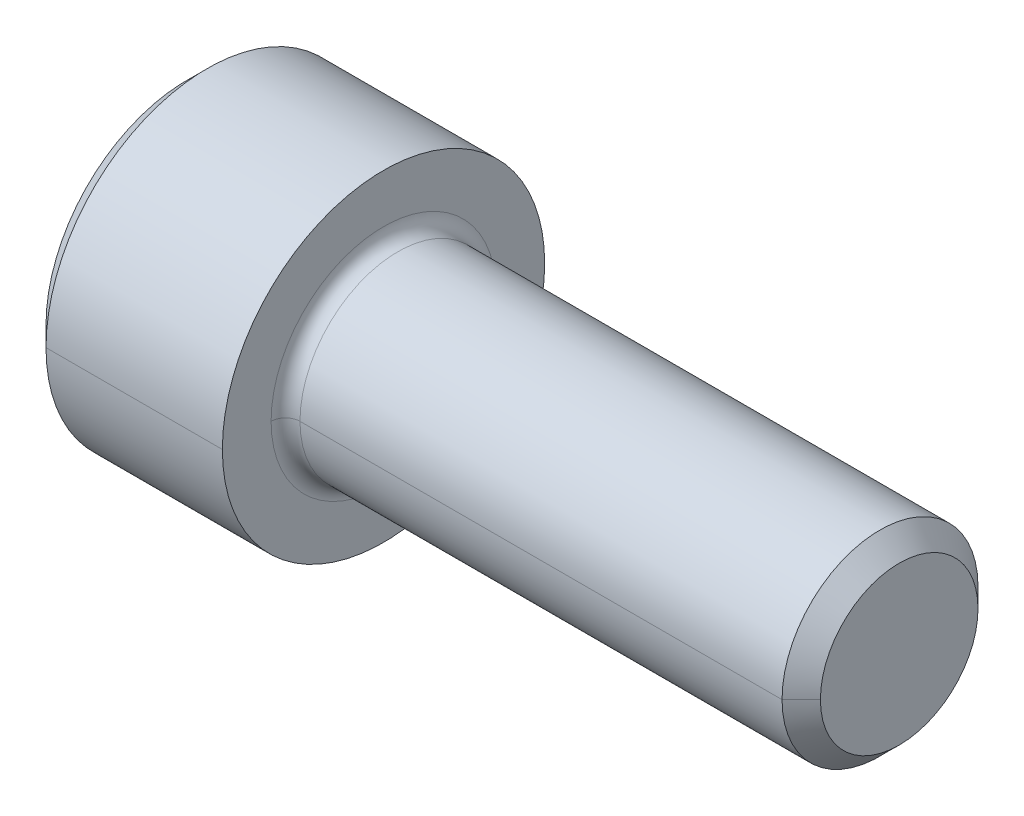
ISO-10303-21;
HEADER;
FILE_DESCRIPTION(('STEP AP214'),'2;1');
FILE_NAME('part.step','',(''),(''),'','','');
FILE_SCHEMA(('AUTOMOTIVE_DESIGN { 1 0 10303 214 1 1 1 1 }'));
ENDSEC;
DATA;
#1=APPLICATION_CONTEXT('core data for automotive mechanical design processes');
#2=APPLICATION_PROTOCOL_DEFINITION('international standard','automotive_design',2000,#1);
#3=PRODUCT_CONTEXT('',#1,'mechanical');
#4=PRODUCT('Part','Part','',(#3));
#5=PRODUCT_RELATED_PRODUCT_CATEGORY('part','',(#4));
#6=PRODUCT_DEFINITION_FORMATION('','',#4);
#7=PRODUCT_DEFINITION_CONTEXT('part definition',#1,'design');
#8=PRODUCT_DEFINITION('design','',#6,#7);
#9=PRODUCT_DEFINITION_SHAPE('','',#8);
#10=(LENGTH_UNIT() NAMED_UNIT(*) SI_UNIT(.MILLI.,.METRE.));
#11=(NAMED_UNIT(*) PLANE_ANGLE_UNIT() SI_UNIT($,.RADIAN.));
#12=(NAMED_UNIT(*) SI_UNIT($,.STERADIAN.) SOLID_ANGLE_UNIT());
#13=UNCERTAINTY_MEASURE_WITH_UNIT(LENGTH_MEASURE(1.E-05),#10,'distance_accuracy_value','');
#14=(GEOMETRIC_REPRESENTATION_CONTEXT(3) GLOBAL_UNCERTAINTY_ASSIGNED_CONTEXT((#13)) GLOBAL_UNIT_ASSIGNED_CONTEXT((#10,
#11,#12)) REPRESENTATION_CONTEXT('',''));
#15=CARTESIAN_POINT('',(0.,0.,0.));
#16=DIRECTION('',(0.,0.,1.));
#17=DIRECTION('',(1.,0.,0.));
#18=AXIS2_PLACEMENT_3D('',#15,#16,#17);
#19=CARTESIAN_POINT('',(2.286,0.,0.));
#20=DIRECTION('',(-1.,0.,0.));
#21=DIRECTION('',(0.,0.,1.));
#22=AXIS2_PLACEMENT_3D('',#19,#20,#21);
#23=CONICAL_SURFACE('',#22,1.98501,1.0471975511966);
#24=DIRECTION('',(-0.5,0.,-0.866025403784437));
#25=VECTOR('',#24,1.);
#26=CARTESIAN_POINT('',(2.286,0.,-1.98501));
#27=LINE('',#26,#25);
#28=CARTESIAN_POINT('',(3.43204605784411,0.,0.));
#29=VERTEX_POINT('',#28);
#30=CARTESIAN_POINT('',(2.286,0.,-1.98501));
#31=VERTEX_POINT('',#30);
#32=EDGE_CURVE('E367',#29,#31,#27,.T.);
#33=ORIENTED_EDGE('',*,*,#32,.F.);
#34=DIRECTION('',(-0.5,0.,0.866025403784437));
#35=VECTOR('',#34,1.);
#36=CARTESIAN_POINT('',(2.286,0.,1.98501));
#37=LINE('',#36,#35);
#38=CARTESIAN_POINT('',(2.286,0.,1.98501));
#39=VERTEX_POINT('',#38);
#40=EDGE_CURVE('E410',#29,#39,#37,.T.);
#41=ORIENTED_EDGE('',*,*,#40,.T.);
#42=CARTESIAN_POINT('',(2.286,0.,0.));
#43=DIRECTION('',(-1.,0.,0.));
#44=DIRECTION('',(0.,0.,1.));
#45=AXIS2_PLACEMENT_3D('',#42,#43,#44);
#46=CIRCLE('',#45,1.98501);
#47=CARTESIAN_POINT('',(2.286,1.71906908676615,0.992505));
#48=VERTEX_POINT('',#47);
#49=EDGE_CURVE('E11',#39,#48,#46,.T.);
#50=ORIENTED_EDGE('',*,*,#49,.T.);
#51=CARTESIAN_POINT('',(2.286,0.,0.));
#52=DIRECTION('',(-1.,0.,0.));
#53=DIRECTION('',(0.,0.,1.));
#54=AXIS2_PLACEMENT_3D('',#51,#52,#53);
#55=CIRCLE('',#54,1.98501);
#56=CARTESIAN_POINT('',(2.286,1.71906908676615,-0.992505));
#57=VERTEX_POINT('',#56);
#58=EDGE_CURVE('E26',#48,#57,#55,.T.);
#59=ORIENTED_EDGE('',*,*,#58,.T.);
#60=CARTESIAN_POINT('',(2.286,0.,0.));
#61=DIRECTION('',(-1.,0.,0.));
#62=DIRECTION('',(0.,0.,1.));
#63=AXIS2_PLACEMENT_3D('',#60,#61,#62);
#64=CIRCLE('',#63,1.98501);
#65=EDGE_CURVE('E204',#57,#31,#64,.T.);
#66=ORIENTED_EDGE('',*,*,#65,.T.);
#67=EDGE_LOOP('',(#33,#41,#50,#59,#66));
#68=FACE_BOUND('',#67,.T.);
#69=ADVANCED_FACE('F17',(#68),#23,.F.);
#70=CARTESIAN_POINT('',(2.286,1.14604605784411,1.98501));
#71=DIRECTION('',(-1.,0.,0.));
#72=DIRECTION('',(0.,0.,1.));
#73=AXIS2_PLACEMENT_3D('',#70,#71,#72);
#74=PLANE('',#73);
#75=ORIENTED_EDGE('',*,*,#49,.F.);
#76=DIRECTION('',(0.,1.,0.));
#77=VECTOR('',#76,1.);
#78=CARTESIAN_POINT('',(2.286,-1.14604605784409,1.98501));
#79=LINE('',#78,#77);
#80=CARTESIAN_POINT('',(2.286,1.14604605784411,1.98501));
#81=VERTEX_POINT('',#80);
#82=EDGE_CURVE('E263',#39,#81,#79,.T.);
#83=ORIENTED_EDGE('',*,*,#82,.T.);
#84=DIRECTION('',(0.,-0.5,0.86602540378444));
#85=VECTOR('',#84,1.);
#86=CARTESIAN_POINT('',(2.286,2.29209211568821,0.));
#87=LINE('',#86,#85);
#88=EDGE_CURVE('E310',#48,#81,#87,.T.);
#89=ORIENTED_EDGE('',*,*,#88,.F.);
#90=EDGE_LOOP('',(#75,#83,#89));
#91=FACE_BOUND('',#90,.T.);
#92=ADVANCED_FACE('F807',(#91),#74,.T.);
#93=CARTESIAN_POINT('',(2.286,1.14604605784411,1.98501));
#94=DIRECTION('',(-1.,0.,0.));
#95=DIRECTION('',(0.,0.,1.));
#96=AXIS2_PLACEMENT_3D('',#93,#94,#95);
#97=PLANE('',#96);
#98=ORIENTED_EDGE('',*,*,#58,.F.);
#99=DIRECTION('',(0.,-0.5,0.86602540378444));
#100=VECTOR('',#99,1.);
#101=CARTESIAN_POINT('',(2.286,2.29209211568821,0.));
#102=LINE('',#101,#100);
#103=CARTESIAN_POINT('',(2.286,2.29209211568821,0.));
#104=VERTEX_POINT('',#103);
#105=EDGE_CURVE('E306',#104,#48,#102,.T.);
#106=ORIENTED_EDGE('',*,*,#105,.F.);
#107=DIRECTION('',(0.,-0.5,-0.866025403784438));
#108=VECTOR('',#107,1.);
#109=CARTESIAN_POINT('',(2.286,2.29209211568821,0.));
#110=LINE('',#109,#108);
#111=EDGE_CURVE('E200',#104,#57,#110,.T.);
#112=ORIENTED_EDGE('',*,*,#111,.T.);
#113=EDGE_LOOP('',(#98,#106,#112));
#114=FACE_BOUND('',#113,.T.);
#115=ADVANCED_FACE('F617',(#114),#97,.T.);
#116=CARTESIAN_POINT('',(2.286,1.14604605784411,1.98501));
#117=DIRECTION('',(-1.,0.,0.));
#118=DIRECTION('',(0.,0.,1.));
#119=AXIS2_PLACEMENT_3D('',#116,#117,#118);
#120=PLANE('',#119);
#121=ORIENTED_EDGE('',*,*,#65,.F.);
#122=DIRECTION('',(0.,-0.5,-0.866025403784438));
#123=VECTOR('',#122,1.);
#124=CARTESIAN_POINT('',(2.286,2.29209211568821,0.));
#125=LINE('',#124,#123);
#126=CARTESIAN_POINT('',(2.286,1.1460460578441,-1.98501));
#127=VERTEX_POINT('',#126);
#128=EDGE_CURVE('E199',#57,#127,#125,.T.);
#129=ORIENTED_EDGE('',*,*,#128,.T.);
#130=DIRECTION('',(0.,-1.,0.));
#131=VECTOR('',#130,1.);
#132=CARTESIAN_POINT('',(2.286,1.1460460578441,-1.98501));
#133=LINE('',#132,#131);
#134=EDGE_CURVE('E170',#127,#31,#133,.T.);
#135=ORIENTED_EDGE('',*,*,#134,.T.);
#136=EDGE_LOOP('',(#121,#129,#135));
#137=FACE_BOUND('',#136,.T.);
#138=ADVANCED_FACE('F613',(#137),#120,.T.);
#139=CARTESIAN_POINT('',(2.286,1.14604605784411,1.98501));
#140=DIRECTION('',(-1.,0.,0.));
#141=DIRECTION('',(0.,0.,1.));
#142=AXIS2_PLACEMENT_3D('',#139,#140,#141);
#143=PLANE('',#142);
#144=CARTESIAN_POINT('',(2.286,0.,0.));
#145=DIRECTION('',(-1.,0.,0.));
#146=DIRECTION('',(0.,0.,1.));
#147=AXIS2_PLACEMENT_3D('',#144,#145,#146);
#148=CIRCLE('',#147,1.98501);
#149=CARTESIAN_POINT('',(2.286,-1.71906908676615,-0.992505));
#150=VERTEX_POINT('',#149);
#151=EDGE_CURVE('E165',#31,#150,#148,.T.);
#152=ORIENTED_EDGE('',*,*,#151,.F.);
#153=DIRECTION('',(0.,-1.,0.));
#154=VECTOR('',#153,1.);
#155=CARTESIAN_POINT('',(2.286,1.1460460578441,-1.98501));
#156=LINE('',#155,#154);
#157=CARTESIAN_POINT('',(2.286,-1.1460460578441,-1.98501));
#158=VERTEX_POINT('',#157);
#159=EDGE_CURVE('E158',#31,#158,#156,.T.);
#160=ORIENTED_EDGE('',*,*,#159,.T.);
#161=DIRECTION('',(0.,0.5,-0.86602540378444));
#162=VECTOR('',#161,1.);
#163=CARTESIAN_POINT('',(2.286,-2.2920921156882,0.));
#164=LINE('',#163,#162);
#165=EDGE_CURVE('E162',#150,#158,#164,.T.);
#166=ORIENTED_EDGE('',*,*,#165,.F.);
#167=EDGE_LOOP('',(#152,#160,#166));
#168=FACE_BOUND('',#167,.T.);
#169=ADVANCED_FACE('F160',(#168),#143,.T.);
#170=CARTESIAN_POINT('',(2.286,1.14604605784411,1.98501));
#171=DIRECTION('',(-1.,0.,0.));
#172=DIRECTION('',(0.,0.,1.));
#173=AXIS2_PLACEMENT_3D('',#170,#171,#172);
#174=PLANE('',#173);
#175=CARTESIAN_POINT('',(2.286,0.,0.));
#176=DIRECTION('',(-1.,0.,0.));
#177=DIRECTION('',(0.,0.,1.));
#178=AXIS2_PLACEMENT_3D('',#175,#176,#177);
#179=CIRCLE('',#178,1.98501);
#180=CARTESIAN_POINT('',(2.286,-1.71906908676614,0.992505));
#181=VERTEX_POINT('',#180);
#182=EDGE_CURVE('E358',#150,#181,#179,.T.);
#183=ORIENTED_EDGE('',*,*,#182,.F.);
#184=DIRECTION('',(0.,0.5,-0.86602540378444));
#185=VECTOR('',#184,1.);
#186=CARTESIAN_POINT('',(2.286,-2.2920921156882,0.));
#187=LINE('',#186,#185);
#188=CARTESIAN_POINT('',(2.286,-2.2920921156882,0.));
#189=VERTEX_POINT('',#188);
#190=EDGE_CURVE('E184',#189,#150,#187,.T.);
#191=ORIENTED_EDGE('',*,*,#190,.F.);
#192=DIRECTION('',(0.,-0.5,-0.866025403784438));
#193=VECTOR('',#192,1.);
#194=CARTESIAN_POINT('',(2.286,-1.14604605784409,1.98501));
#195=LINE('',#194,#193);
#196=EDGE_CURVE('E326',#181,#189,#195,.T.);
#197=ORIENTED_EDGE('',*,*,#196,.F.);
#198=EDGE_LOOP('',(#183,#191,#197));
#199=FACE_BOUND('',#198,.T.);
#200=ADVANCED_FACE('F785',(#199),#174,.T.);
#201=CARTESIAN_POINT('',(2.286,1.14604605784411,1.98501));
#202=DIRECTION('',(-1.,0.,0.));
#203=DIRECTION('',(0.,0.,1.));
#204=AXIS2_PLACEMENT_3D('',#201,#202,#203);
#205=PLANE('',#204);
#206=CARTESIAN_POINT('',(2.286,0.,0.));
#207=DIRECTION('',(-1.,0.,0.));
#208=DIRECTION('',(0.,0.,1.));
#209=AXIS2_PLACEMENT_3D('',#206,#207,#208);
#210=CIRCLE('',#209,1.98501);
#211=EDGE_CURVE('E350',#181,#39,#210,.T.);
#212=ORIENTED_EDGE('',*,*,#211,.F.);
#213=DIRECTION('',(0.,-0.5,-0.866025403784438));
#214=VECTOR('',#213,1.);
#215=CARTESIAN_POINT('',(2.286,-1.14604605784409,1.98501));
#216=LINE('',#215,#214);
#217=CARTESIAN_POINT('',(2.286,-1.14604605784409,1.98501));
#218=VERTEX_POINT('',#217);
#219=EDGE_CURVE('E322',#218,#181,#216,.T.);
#220=ORIENTED_EDGE('',*,*,#219,.F.);
#221=DIRECTION('',(0.,1.,0.));
#222=VECTOR('',#221,1.);
#223=CARTESIAN_POINT('',(2.286,-1.14604605784409,1.98501));
#224=LINE('',#223,#222);
#225=EDGE_CURVE('E266',#218,#39,#224,.T.);
#226=ORIENTED_EDGE('',*,*,#225,.T.);
#227=EDGE_LOOP('',(#212,#220,#226));
#228=FACE_BOUND('',#227,.T.);
#229=ADVANCED_FACE('F352',(#228),#205,.T.);
#230=CARTESIAN_POINT('',(2.286,2.29209211568821,0.));
#231=DIRECTION('',(0.,0.866025403784438,-0.5));
#232=DIRECTION('',(-1.,0.,0.));
#233=AXIS2_PLACEMENT_3D('',#230,#231,#232);
#234=PLANE('',#233);
#235=DIRECTION('',(0.,-0.5,-0.866025403784438));
#236=VECTOR('',#235,1.);
#237=CARTESIAN_POINT('',(0.,2.29209211568821,0.));
#238=LINE('',#237,#236);
#239=CARTESIAN_POINT('',(0.,2.29209211568821,0.));
#240=VERTEX_POINT('',#239);
#241=CARTESIAN_POINT('',(0.,1.1460460578441,-1.98501));
#242=VERTEX_POINT('',#241);
#243=EDGE_CURVE('E291',#240,#242,#238,.T.);
#244=ORIENTED_EDGE('',*,*,#243,.T.);
#245=DIRECTION('',(-1.,0.,0.));
#246=VECTOR('',#245,1.);
#247=CARTESIAN_POINT('',(2.286,1.1460460578441,-1.98501));
#248=LINE('',#247,#246);
#249=EDGE_CURVE('E196',#127,#242,#248,.T.);
#250=ORIENTED_EDGE('',*,*,#249,.F.);
#251=ORIENTED_EDGE('',*,*,#128,.F.);
#252=ORIENTED_EDGE('',*,*,#111,.F.);
#253=DIRECTION('',(-1.,0.,0.));
#254=VECTOR('',#253,1.);
#255=CARTESIAN_POINT('',(2.286,2.29209211568821,0.));
#256=LINE('',#255,#254);
#257=EDGE_CURVE('E303',#104,#240,#256,.T.);
#258=ORIENTED_EDGE('',*,*,#257,.T.);
#259=EDGE_LOOP('',(#244,#250,#251,#252,#258));
#260=FACE_BOUND('',#259,.T.);
#261=ADVANCED_FACE('F769',(#260),#234,.F.);
#262=CARTESIAN_POINT('',(2.286,1.1460460578441,-1.98501));
#263=DIRECTION('',(0.,0.,-1.));
#264=DIRECTION('',(0.,-1.,0.));
#265=AXIS2_PLACEMENT_3D('',#262,#263,#264);
#266=PLANE('',#265);
#267=DIRECTION('',(0.,-1.,0.));
#268=VECTOR('',#267,1.);
#269=CARTESIAN_POINT('',(0.,1.1460460578441,-1.98501));
#270=LINE('',#269,#268);
#271=CARTESIAN_POINT('',(0.,-1.1460460578441,-1.98501));
#272=VERTEX_POINT('',#271);
#273=EDGE_CURVE('E176',#242,#272,#270,.T.);
#274=ORIENTED_EDGE('',*,*,#273,.T.);
#275=DIRECTION('',(-1.,0.,0.));
#276=VECTOR('',#275,1.);
#277=CARTESIAN_POINT('',(2.286,-1.1460460578441,-1.98501));
#278=LINE('',#277,#276);
#279=EDGE_CURVE('E171',#158,#272,#278,.T.);
#280=ORIENTED_EDGE('',*,*,#279,.F.);
#281=ORIENTED_EDGE('',*,*,#159,.F.);
#282=ORIENTED_EDGE('',*,*,#134,.F.);
#283=ORIENTED_EDGE('',*,*,#249,.T.);
#284=EDGE_LOOP('',(#274,#280,#281,#282,#283));
#285=FACE_BOUND('',#284,.T.);
#286=ADVANCED_FACE('F174',(#285),#266,.F.);
#287=CARTESIAN_POINT('',(2.286,-2.2920921156882,0.));
#288=DIRECTION('',(0.,0.866025403784439,0.5));
#289=DIRECTION('',(1.,0.,0.));
#290=AXIS2_PLACEMENT_3D('',#287,#288,#289);
#291=PLANE('',#290);
#292=DIRECTION('',(0.,0.5,-0.86602540378444));
#293=VECTOR('',#292,1.);
#294=CARTESIAN_POINT('',(0.,-2.2920921156882,0.));
#295=LINE('',#294,#293);
#296=CARTESIAN_POINT('',(0.,-2.2920921156882,0.));
#297=VERTEX_POINT('',#296);
#298=EDGE_CURVE('E286',#297,#272,#295,.T.);
#299=ORIENTED_EDGE('',*,*,#298,.F.);
#300=DIRECTION('',(-1.,0.,0.));
#301=VECTOR('',#300,1.);
#302=CARTESIAN_POINT('',(2.286,-2.2920921156882,0.));
#303=LINE('',#302,#301);
#304=EDGE_CURVE('E192',#189,#297,#303,.T.);
#305=ORIENTED_EDGE('',*,*,#304,.F.);
#306=ORIENTED_EDGE('',*,*,#190,.T.);
#307=ORIENTED_EDGE('',*,*,#165,.T.);
#308=ORIENTED_EDGE('',*,*,#279,.T.);
#309=EDGE_LOOP('',(#299,#305,#306,#307,#308));
#310=FACE_BOUND('',#309,.T.);
#311=ADVANCED_FACE('F182',(#310),#291,.T.);
#312=CARTESIAN_POINT('',(2.286,-1.14604605784409,1.98501));
#313=DIRECTION('',(0.,0.866025403784438,-0.5));
#314=DIRECTION('',(-1.,0.,0.));
#315=AXIS2_PLACEMENT_3D('',#312,#313,#314);
#316=PLANE('',#315);
#317=DIRECTION('',(0.,-0.5,-0.866025403784438));
#318=VECTOR('',#317,1.);
#319=CARTESIAN_POINT('',(0.,-1.14604605784409,1.98501));
#320=LINE('',#319,#318);
#321=CARTESIAN_POINT('',(0.,-1.14604605784409,1.98501));
#322=VERTEX_POINT('',#321);
#323=EDGE_CURVE('E282',#322,#297,#320,.T.);
#324=ORIENTED_EDGE('',*,*,#323,.F.);
#325=DIRECTION('',(-1.,0.,0.));
#326=VECTOR('',#325,1.);
#327=CARTESIAN_POINT('',(2.286,-1.14604605784409,1.98501));
#328=LINE('',#327,#326);
#329=EDGE_CURVE('E319',#218,#322,#328,.T.);
#330=ORIENTED_EDGE('',*,*,#329,.F.);
#331=ORIENTED_EDGE('',*,*,#219,.T.);
#332=ORIENTED_EDGE('',*,*,#196,.T.);
#333=ORIENTED_EDGE('',*,*,#304,.T.);
#334=EDGE_LOOP('',(#324,#330,#331,#332,#333));
#335=FACE_BOUND('',#334,.T.);
#336=ADVANCED_FACE('F334',(#335),#316,.T.);
#337=CARTESIAN_POINT('',(2.286,-1.14604605784409,1.98501));
#338=DIRECTION('',(0.,0.,1.));
#339=DIRECTION('',(0.,-1.,0.));
#340=AXIS2_PLACEMENT_3D('',#337,#338,#339);
#341=PLANE('',#340);
#342=DIRECTION('',(0.,1.,0.));
#343=VECTOR('',#342,1.);
#344=CARTESIAN_POINT('',(0.,-1.14604605784409,1.98501));
#345=LINE('',#344,#343);
#346=CARTESIAN_POINT('',(0.,1.14604605784411,1.98501));
#347=VERTEX_POINT('',#346);
#348=EDGE_CURVE('E278',#322,#347,#345,.T.);
#349=ORIENTED_EDGE('',*,*,#348,.T.);
#350=DIRECTION('',(-1.,0.,0.));
#351=VECTOR('',#350,1.);
#352=CARTESIAN_POINT('',(2.286,1.14604605784411,1.98501));
#353=LINE('',#352,#351);
#354=EDGE_CURVE('E267',#81,#347,#353,.T.);
#355=ORIENTED_EDGE('',*,*,#354,.F.);
#356=ORIENTED_EDGE('',*,*,#82,.F.);
#357=ORIENTED_EDGE('',*,*,#225,.F.);
#358=ORIENTED_EDGE('',*,*,#329,.T.);
#359=EDGE_LOOP('',(#349,#355,#356,#357,#358));
#360=FACE_BOUND('',#359,.T.);
#361=ADVANCED_FACE('F344',(#360),#341,.F.);
#362=CARTESIAN_POINT('',(2.286,2.29209211568821,0.));
#363=DIRECTION('',(0.,-0.86602540378444,-0.5));
#364=DIRECTION('',(0.,0.5,-0.86602540378444));
#365=AXIS2_PLACEMENT_3D('',#362,#363,#364);
#366=PLANE('',#365);
#367=DIRECTION('',(0.,-0.5,0.86602540378444));
#368=VECTOR('',#367,1.);
#369=CARTESIAN_POINT('',(0.,2.29209211568821,0.));
#370=LINE('',#369,#368);
#371=EDGE_CURVE('E273',#240,#347,#370,.T.);
#372=ORIENTED_EDGE('',*,*,#371,.F.);
#373=ORIENTED_EDGE('',*,*,#257,.F.);
#374=ORIENTED_EDGE('',*,*,#105,.T.);
#375=ORIENTED_EDGE('',*,*,#88,.T.);
#376=ORIENTED_EDGE('',*,*,#354,.T.);
#377=EDGE_LOOP('',(#372,#373,#374,#375,#376));
#378=FACE_BOUND('',#377,.T.);
#379=ADVANCED_FACE('F689',(#378),#366,.T.);
#380=CARTESIAN_POINT('',(5.1816,0.,0.));
#381=DIRECTION('',(1.,0.,0.));
#382=DIRECTION('',(0.,0.,-1.));
#383=AXIS2_PLACEMENT_3D('',#380,#381,#382);
#384=TOROIDAL_SURFACE('',#383,2.7686,0.3556);
#385=CARTESIAN_POINT('',(5.1816,0.,2.7686));
#386=DIRECTION('',(0.,1.,0.));
#387=DIRECTION('',(0.,0.,1.));
#388=AXIS2_PLACEMENT_3D('',#385,#386,#387);
#389=CIRCLE('',#388,0.3556);
#390=CARTESIAN_POINT('',(5.1816,0.,2.413));
#391=VERTEX_POINT('',#390);
#392=CARTESIAN_POINT('',(4.826,0.,2.7686));
#393=VERTEX_POINT('',#392);
#394=EDGE_CURVE('E374',#391,#393,#389,.T.);
#395=ORIENTED_EDGE('',*,*,#394,.F.);
#396=CARTESIAN_POINT('',(5.1816,0.,0.));
#397=DIRECTION('',(1.,0.,0.));
#398=DIRECTION('',(0.,0.,-1.));
#399=AXIS2_PLACEMENT_3D('',#396,#397,#398);
#400=CIRCLE('',#399,2.413);
#401=CARTESIAN_POINT('',(5.1816,0.,-2.413));
#402=VERTEX_POINT('',#401);
#403=EDGE_CURVE('E233',#402,#391,#400,.T.);
#404=ORIENTED_EDGE('',*,*,#403,.F.);
#405=CARTESIAN_POINT('',(5.1816,0.,-2.7686));
#406=DIRECTION('',(0.,-1.,0.));
#407=DIRECTION('',(0.,0.,-1.));
#408=AXIS2_PLACEMENT_3D('',#405,#406,#407);
#409=CIRCLE('',#408,0.3556);
#410=CARTESIAN_POINT('',(4.826,0.,-2.7686));
#411=VERTEX_POINT('',#410);
#412=EDGE_CURVE('E379',#402,#411,#409,.T.);
#413=ORIENTED_EDGE('',*,*,#412,.T.);
#414=CARTESIAN_POINT('',(4.826,0.,0.));
#415=DIRECTION('',(-1.,0.,0.));
#416=DIRECTION('',(0.,0.,-1.));
#417=AXIS2_PLACEMENT_3D('',#414,#415,#416);
#418=CIRCLE('',#417,2.7686);
#419=EDGE_CURVE('E229',#393,#411,#418,.T.);
#420=ORIENTED_EDGE('',*,*,#419,.F.);
#421=EDGE_LOOP('',(#395,#404,#413,#420));
#422=FACE_BOUND('',#421,.T.);
#423=ADVANCED_FACE('F393',(#422),#384,.F.);
#424=CARTESIAN_POINT('',(17.526,1.94056,0.));
#425=DIRECTION('',(1.,0.,0.));
#426=DIRECTION('',(0.,1.,0.));
#427=AXIS2_PLACEMENT_3D('',#424,#425,#426);
#428=PLANE('',#427);
#429=CARTESIAN_POINT('',(17.526,0.,0.));
#430=DIRECTION('',(-1.,0.,0.));
#431=DIRECTION('',(0.,0.,1.));
#432=AXIS2_PLACEMENT_3D('',#429,#430,#431);
#433=CIRCLE('',#432,1.94056);
#434=CARTESIAN_POINT('',(17.526,0.,1.94056));
#435=VERTEX_POINT('',#434);
#436=CARTESIAN_POINT('',(17.526,0.,-1.94056));
#437=VERTEX_POINT('',#436);
#438=EDGE_CURVE('E375',#435,#437,#433,.T.);
#439=ORIENTED_EDGE('',*,*,#438,.F.);
#440=CARTESIAN_POINT('',(17.526,0.,0.));
#441=DIRECTION('',(-1.,0.,0.));
#442=DIRECTION('',(0.,0.,1.));
#443=AXIS2_PLACEMENT_3D('',#440,#441,#442);
#444=CIRCLE('',#443,1.94056);
#445=EDGE_CURVE('E228',#437,#435,#444,.T.);
#446=ORIENTED_EDGE('',*,*,#445,.F.);
#447=EDGE_LOOP('',(#439,#446));
#448=FACE_BOUND('',#447,.T.);
#449=ADVANCED_FACE('F704',(#448),#428,.T.);
#450=CARTESIAN_POINT('',(17.526,0.,0.));
#451=DIRECTION('',(-1.,0.,0.));
#452=DIRECTION('',(0.,0.,1.));
#453=AXIS2_PLACEMENT_3D('',#450,#451,#452);
#454=CONICAL_SURFACE('',#453,1.94056,0.785398163397401);
#455=DIRECTION('',(-0.707106781186582,0.,-0.707106781186514));
#456=VECTOR('',#455,1.);
#457=CARTESIAN_POINT('',(17.526,0.,-1.94056));
#458=LINE('',#457,#456);
#459=CARTESIAN_POINT('',(17.05356,0.,-2.41299999999997));
#460=VERTEX_POINT('',#459);
#461=EDGE_CURVE('E217',#437,#460,#458,.T.);
#462=ORIENTED_EDGE('',*,*,#461,.F.);
#463=ORIENTED_EDGE('',*,*,#445,.T.);
#464=DIRECTION('',(-0.707106781186582,0.,0.707106781186514));
#465=VECTOR('',#464,1.);
#466=CARTESIAN_POINT('',(17.526,0.,1.94056));
#467=LINE('',#466,#465);
#468=CARTESIAN_POINT('',(17.05356,0.,2.41299999999997));
#469=VERTEX_POINT('',#468);
#470=EDGE_CURVE('E219',#435,#469,#467,.T.);
#471=ORIENTED_EDGE('',*,*,#470,.T.);
#472=CARTESIAN_POINT('',(17.05356,0.,0.));
#473=DIRECTION('',(-1.,0.,0.));
#474=DIRECTION('',(0.,0.,1.));
#475=AXIS2_PLACEMENT_3D('',#472,#473,#474);
#476=CIRCLE('',#475,2.41299999999997);
#477=EDGE_CURVE('E225',#460,#469,#476,.T.);
#478=ORIENTED_EDGE('',*,*,#477,.F.);
#479=EDGE_LOOP('',(#462,#463,#471,#478));
#480=FACE_BOUND('',#479,.T.);
#481=ADVANCED_FACE('F720',(#480),#454,.T.);
#482=CARTESIAN_POINT('',(-31.75,0.,0.));
#483=DIRECTION('',(-1.,0.,0.));
#484=DIRECTION('',(0.,0.,1.));
#485=AXIS2_PLACEMENT_3D('',#482,#483,#484);
#486=CYLINDRICAL_SURFACE('',#485,2.413);
#487=DIRECTION('',(-1.,0.,0.));
#488=VECTOR('',#487,1.);
#489=CARTESIAN_POINT('',(-31.75,0.,-2.413));
#490=LINE('',#489,#488);
#491=EDGE_CURVE('E223',#460,#402,#490,.T.);
#492=ORIENTED_EDGE('',*,*,#491,.F.);
#493=ORIENTED_EDGE('',*,*,#477,.T.);
#494=DIRECTION('',(-1.,0.,0.));
#495=VECTOR('',#494,1.);
#496=CARTESIAN_POINT('',(-31.75,0.,2.413));
#497=LINE('',#496,#495);
#498=EDGE_CURVE('E237',#469,#391,#497,.T.);
#499=ORIENTED_EDGE('',*,*,#498,.T.);
#500=CARTESIAN_POINT('',(5.1816,0.,0.));
#501=DIRECTION('',(1.,0.,0.));
#502=DIRECTION('',(0.,0.,-1.));
#503=AXIS2_PLACEMENT_3D('',#500,#501,#502);
#504=CIRCLE('',#503,2.413);
#505=EDGE_CURVE('E357',#391,#402,#504,.T.);
#506=ORIENTED_EDGE('',*,*,#505,.T.);
#507=EDGE_LOOP('',(#492,#493,#499,#506));
#508=FACE_BOUND('',#507,.T.);
#509=ADVANCED_FACE('F712',(#508),#486,.T.);
#510=CARTESIAN_POINT('',(4.826,3.96875,0.));
#511=DIRECTION('',(1.,0.,0.));
#512=DIRECTION('',(0.,1.,0.));
#513=AXIS2_PLACEMENT_3D('',#510,#511,#512);
#514=PLANE('',#513);
#515=CARTESIAN_POINT('',(4.826,0.,0.));
#516=DIRECTION('',(-1.,0.,0.));
#517=DIRECTION('',(0.,0.,-1.));
#518=AXIS2_PLACEMENT_3D('',#515,#516,#517);
#519=CIRCLE('',#518,2.7686);
#520=EDGE_CURVE('E380',#411,#393,#519,.T.);
#521=ORIENTED_EDGE('',*,*,#520,.T.);
#522=ORIENTED_EDGE('',*,*,#419,.T.);
#523=EDGE_LOOP('',(#521,#522));
#524=FACE_BOUND('',#523,.T.);
#525=CARTESIAN_POINT('',(4.826,0.,0.));
#526=DIRECTION('',(-1.,0.,0.));
#527=DIRECTION('',(0.,0.,1.));
#528=AXIS2_PLACEMENT_3D('',#525,#526,#527);
#529=CIRCLE('',#528,3.96875);
#530=CARTESIAN_POINT('',(4.826,0.,3.96875));
#531=VERTEX_POINT('',#530);
#532=CARTESIAN_POINT('',(4.826,0.,-3.96875));
#533=VERTEX_POINT('',#532);
#534=EDGE_CURVE('E238',#531,#533,#529,.T.);
#535=ORIENTED_EDGE('',*,*,#534,.F.);
#536=CARTESIAN_POINT('',(4.826,0.,0.));
#537=DIRECTION('',(-1.,0.,0.));
#538=DIRECTION('',(0.,0.,1.));
#539=AXIS2_PLACEMENT_3D('',#536,#537,#538);
#540=CIRCLE('',#539,3.96875);
#541=EDGE_CURVE('E298',#533,#531,#540,.T.);
#542=ORIENTED_EDGE('',*,*,#541,.F.);
#543=EDGE_LOOP('',(#535,#542));
#544=FACE_BOUND('',#543,.T.);
#545=ADVANCED_FACE('F399',(#524,#544),#514,.T.);
#546=CARTESIAN_POINT('',(-31.75,0.,0.));
#547=DIRECTION('',(-1.,0.,0.));
#548=DIRECTION('',(0.,0.,1.));
#549=AXIS2_PLACEMENT_3D('',#546,#547,#548);
#550=CYLINDRICAL_SURFACE('',#549,3.96875);
#551=DIRECTION('',(-1.,0.,0.));
#552=VECTOR('',#551,1.);
#553=CARTESIAN_POINT('',(-31.75,0.,-3.96875));
#554=LINE('',#553,#552);
#555=CARTESIAN_POINT('',(0.4826,0.,-3.96875));
#556=VERTEX_POINT('',#555);
#557=EDGE_CURVE('E242',#533,#556,#554,.T.);
#558=ORIENTED_EDGE('',*,*,#557,.F.);
#559=ORIENTED_EDGE('',*,*,#541,.T.);
#560=DIRECTION('',(-1.,0.,0.));
#561=VECTOR('',#560,1.);
#562=CARTESIAN_POINT('',(-31.75,0.,3.96875));
#563=LINE('',#562,#561);
#564=CARTESIAN_POINT('',(0.4826,0.,3.96875));
#565=VERTEX_POINT('',#564);
#566=EDGE_CURVE('E250',#531,#565,#563,.T.);
#567=ORIENTED_EDGE('',*,*,#566,.T.);
#568=CARTESIAN_POINT('',(0.4826,0.,0.));
#569=DIRECTION('',(-1.,0.,0.));
#570=DIRECTION('',(0.,0.,1.));
#571=AXIS2_PLACEMENT_3D('',#568,#569,#570);
#572=CIRCLE('',#571,3.96875);
#573=EDGE_CURVE('E295',#556,#565,#572,.T.);
#574=ORIENTED_EDGE('',*,*,#573,.F.);
#575=EDGE_LOOP('',(#558,#559,#567,#574));
#576=FACE_BOUND('',#575,.T.);
#577=ADVANCED_FACE('F607',(#576),#550,.T.);
#578=CARTESIAN_POINT('',(0.,0.,0.));
#579=DIRECTION('',(1.,0.,0.));
#580=DIRECTION('',(0.,0.,-1.));
#581=AXIS2_PLACEMENT_3D('',#578,#579,#580);
#582=CONICAL_SURFACE('',#581,3.48615,0.78539816339745);
#583=DIRECTION('',(0.707106781186546,0.,0.707106781186549));
#584=VECTOR('',#583,1.);
#585=CARTESIAN_POINT('',(0.,0.,3.48615));
#586=LINE('',#585,#584);
#587=CARTESIAN_POINT('',(0.,0.,3.48615));
#588=VERTEX_POINT('',#587);
#589=EDGE_CURVE('E258',#588,#565,#586,.T.);
#590=ORIENTED_EDGE('',*,*,#589,.F.);
#591=CARTESIAN_POINT('',(0.,0.,0.));
#592=DIRECTION('',(-1.,0.,0.));
#593=DIRECTION('',(0.,0.,1.));
#594=AXIS2_PLACEMENT_3D('',#591,#592,#593);
#595=CIRCLE('',#594,3.48615);
#596=CARTESIAN_POINT('',(0.,0.,-3.48615));
#597=VERTEX_POINT('',#596);
#598=EDGE_CURVE('E271',#597,#588,#595,.T.);
#599=ORIENTED_EDGE('',*,*,#598,.F.);
#600=DIRECTION('',(0.707106781186546,0.,-0.707106781186549));
#601=VECTOR('',#600,1.);
#602=CARTESIAN_POINT('',(0.,0.,-3.48615));
#603=LINE('',#602,#601);
#604=EDGE_CURVE('E262',#597,#556,#603,.T.);
#605=ORIENTED_EDGE('',*,*,#604,.T.);
#606=ORIENTED_EDGE('',*,*,#573,.T.);
#607=EDGE_LOOP('',(#590,#599,#605,#606));
#608=FACE_BOUND('',#607,.T.);
#609=ADVANCED_FACE('F603',(#608),#582,.T.);
#610=CARTESIAN_POINT('',(0.,0.,0.));
#611=DIRECTION('',(-1.,0.,0.));
#612=DIRECTION('',(0.,0.,1.));
#613=AXIS2_PLACEMENT_3D('',#610,#611,#612);
#614=PLANE('',#613);
#615=ORIENTED_EDGE('',*,*,#371,.T.);
#616=ORIENTED_EDGE('',*,*,#348,.F.);
#617=ORIENTED_EDGE('',*,*,#323,.T.);
#618=ORIENTED_EDGE('',*,*,#298,.T.);
#619=ORIENTED_EDGE('',*,*,#273,.F.);
#620=ORIENTED_EDGE('',*,*,#243,.F.);
#621=EDGE_LOOP('',(#615,#616,#617,#618,#619,#620));
#622=FACE_BOUND('',#621,.T.);
#623=ORIENTED_EDGE('',*,*,#598,.T.);
#624=CARTESIAN_POINT('',(0.,0.,0.));
#625=DIRECTION('',(-1.,0.,0.));
#626=DIRECTION('',(0.,0.,1.));
#627=AXIS2_PLACEMENT_3D('',#624,#625,#626);
#628=CIRCLE('',#627,3.48615);
#629=EDGE_CURVE('E254',#588,#597,#628,.T.);
#630=ORIENTED_EDGE('',*,*,#629,.T.);
#631=EDGE_LOOP('',(#623,#630));
#632=FACE_BOUND('',#631,.T.);
#633=ADVANCED_FACE('F338',(#622,#632),#614,.T.);
#634=CARTESIAN_POINT('',(0.,0.,0.));
#635=DIRECTION('',(1.,0.,0.));
#636=DIRECTION('',(0.,0.,-1.));
#637=AXIS2_PLACEMENT_3D('',#634,#635,#636);
#638=CONICAL_SURFACE('',#637,3.48615,0.78539816339745);
#639=ORIENTED_EDGE('',*,*,#629,.F.);
#640=ORIENTED_EDGE('',*,*,#589,.T.);
#641=CARTESIAN_POINT('',(0.4826,0.,0.));
#642=DIRECTION('',(-1.,0.,0.));
#643=DIRECTION('',(0.,0.,1.));
#644=AXIS2_PLACEMENT_3D('',#641,#642,#643);
#645=CIRCLE('',#644,3.96875);
#646=EDGE_CURVE('E246',#565,#556,#645,.T.);
#647=ORIENTED_EDGE('',*,*,#646,.T.);
#648=ORIENTED_EDGE('',*,*,#604,.F.);
#649=EDGE_LOOP('',(#639,#640,#647,#648));
#650=FACE_BOUND('',#649,.T.);
#651=ADVANCED_FACE('F672',(#650),#638,.T.);
#652=CARTESIAN_POINT('',(-31.75,0.,0.));
#653=DIRECTION('',(-1.,0.,0.));
#654=DIRECTION('',(0.,0.,1.));
#655=AXIS2_PLACEMENT_3D('',#652,#653,#654);
#656=CYLINDRICAL_SURFACE('',#655,3.96875);
#657=ORIENTED_EDGE('',*,*,#534,.T.);
#658=ORIENTED_EDGE('',*,*,#557,.T.);
#659=ORIENTED_EDGE('',*,*,#646,.F.);
#660=ORIENTED_EDGE('',*,*,#566,.F.);
#661=EDGE_LOOP('',(#657,#658,#659,#660));
#662=FACE_BOUND('',#661,.T.);
#663=ADVANCED_FACE('F659',(#662),#656,.T.);
#664=CARTESIAN_POINT('',(-31.75,0.,0.));
#665=DIRECTION('',(-1.,0.,0.));
#666=DIRECTION('',(0.,0.,1.));
#667=AXIS2_PLACEMENT_3D('',#664,#665,#666);
#668=CYLINDRICAL_SURFACE('',#667,2.413);
#669=CARTESIAN_POINT('',(17.05356,0.,0.));
#670=DIRECTION('',(-1.,0.,0.));
#671=DIRECTION('',(0.,0.,1.));
#672=AXIS2_PLACEMENT_3D('',#669,#670,#671);
#673=CIRCLE('',#672,2.41299999999997);
#674=EDGE_CURVE('E224',#469,#460,#673,.T.);
#675=ORIENTED_EDGE('',*,*,#674,.T.);
#676=ORIENTED_EDGE('',*,*,#491,.T.);
#677=ORIENTED_EDGE('',*,*,#403,.T.);
#678=ORIENTED_EDGE('',*,*,#498,.F.);
#679=EDGE_LOOP('',(#675,#676,#677,#678));
#680=FACE_BOUND('',#679,.T.);
#681=ADVANCED_FACE('F641',(#680),#668,.T.);
#682=CARTESIAN_POINT('',(17.526,0.,0.));
#683=DIRECTION('',(-1.,0.,0.));
#684=DIRECTION('',(0.,0.,1.));
#685=AXIS2_PLACEMENT_3D('',#682,#683,#684);
#686=CONICAL_SURFACE('',#685,1.94056,0.785398163397401);
#687=ORIENTED_EDGE('',*,*,#438,.T.);
#688=ORIENTED_EDGE('',*,*,#461,.T.);
#689=ORIENTED_EDGE('',*,*,#674,.F.);
#690=ORIENTED_EDGE('',*,*,#470,.F.);
#691=EDGE_LOOP('',(#687,#688,#689,#690));
#692=FACE_BOUND('',#691,.T.);
#693=ADVANCED_FACE('F633',(#692),#686,.T.);
#694=CARTESIAN_POINT('',(5.1816,0.,0.));
#695=DIRECTION('',(1.,0.,0.));
#696=DIRECTION('',(0.,0.,-1.));
#697=AXIS2_PLACEMENT_3D('',#694,#695,#696);
#698=TOROIDAL_SURFACE('',#697,2.7686,0.3556);
#699=ORIENTED_EDGE('',*,*,#505,.F.);
#700=ORIENTED_EDGE('',*,*,#394,.T.);
#701=ORIENTED_EDGE('',*,*,#520,.F.);
#702=ORIENTED_EDGE('',*,*,#412,.F.);
#703=EDGE_LOOP('',(#699,#700,#701,#702));
#704=FACE_BOUND('',#703,.T.);
#705=ADVANCED_FACE('F397',(#704),#698,.F.);
#706=CARTESIAN_POINT('',(2.286,0.,0.));
#707=DIRECTION('',(-1.,0.,0.));
#708=DIRECTION('',(0.,0.,1.));
#709=AXIS2_PLACEMENT_3D('',#706,#707,#708);
#710=CONICAL_SURFACE('',#709,1.98501,1.0471975511966);
#711=ORIENTED_EDGE('',*,*,#40,.F.);
#712=ORIENTED_EDGE('',*,*,#32,.T.);
#713=ORIENTED_EDGE('',*,*,#151,.T.);
#714=ORIENTED_EDGE('',*,*,#182,.T.);
#715=ORIENTED_EDGE('',*,*,#211,.T.);
#716=EDGE_LOOP('',(#711,#712,#713,#714,#715));
#717=FACE_BOUND('',#716,.T.);
#718=ADVANCED_FACE('F360',(#717),#710,.F.);
#719=CLOSED_SHELL('',(#69,#92,#115,#138,#169,#200,#229,#261,#286,#311,#336,#361,#379,#423,#449,
#481,#509,#545,#577,#609,#633,#651,#663,#681,#693,#705,#718));
#720=MANIFOLD_SOLID_BREP('B1',#719);
#721=ADVANCED_BREP_SHAPE_REPRESENTATION('',(#18,#720),#14);
#722=SHAPE_DEFINITION_REPRESENTATION(#9,#721);
ENDSEC;
END-ISO-10303-21;
